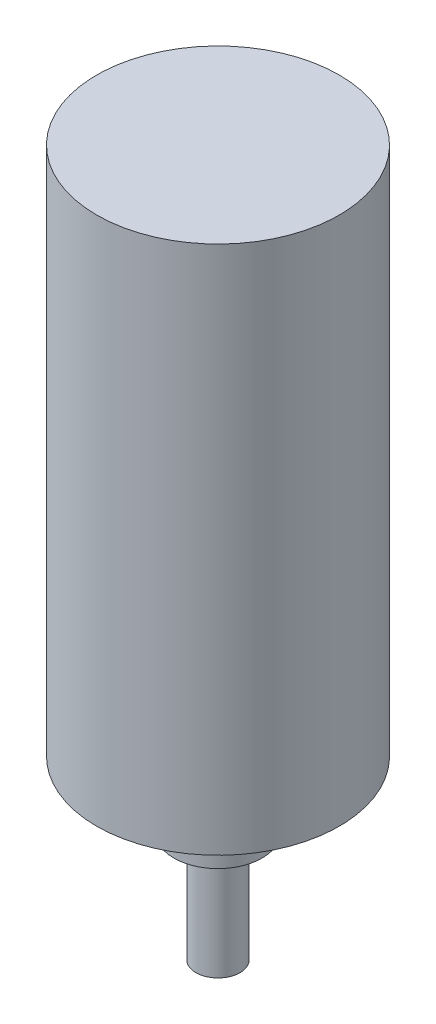
ISO-10303-21;
HEADER;
FILE_DESCRIPTION(('STEP AP214'),'2;1');
FILE_NAME('part.step','',(''),(''),'','','');
FILE_SCHEMA(('AUTOMOTIVE_DESIGN { 1 0 10303 214 1 1 1 1 }'));
ENDSEC;
DATA;
#1=APPLICATION_CONTEXT('core data for automotive mechanical design processes');
#2=APPLICATION_PROTOCOL_DEFINITION('international standard','automotive_design',2000,#1);
#3=PRODUCT_CONTEXT('',#1,'mechanical');
#4=PRODUCT('Part','Part','',(#3));
#5=PRODUCT_RELATED_PRODUCT_CATEGORY('part','',(#4));
#6=PRODUCT_DEFINITION_FORMATION('','',#4);
#7=PRODUCT_DEFINITION_CONTEXT('part definition',#1,'design');
#8=PRODUCT_DEFINITION('design','',#6,#7);
#9=PRODUCT_DEFINITION_SHAPE('','',#8);
#10=(LENGTH_UNIT() NAMED_UNIT(*) SI_UNIT(.MILLI.,.METRE.));
#11=(NAMED_UNIT(*) PLANE_ANGLE_UNIT() SI_UNIT($,.RADIAN.));
#12=(NAMED_UNIT(*) SI_UNIT($,.STERADIAN.) SOLID_ANGLE_UNIT());
#13=UNCERTAINTY_MEASURE_WITH_UNIT(LENGTH_MEASURE(1.E-05),#10,'distance_accuracy_value','');
#14=(GEOMETRIC_REPRESENTATION_CONTEXT(3) GLOBAL_UNCERTAINTY_ASSIGNED_CONTEXT((#13)) GLOBAL_UNIT_ASSIGNED_CONTEXT((#10,
#11,#12)) REPRESENTATION_CONTEXT('',''));
#15=CARTESIAN_POINT('',(0.,0.,0.));
#16=DIRECTION('',(0.,0.,1.));
#17=DIRECTION('',(1.,0.,0.));
#18=AXIS2_PLACEMENT_3D('',#15,#16,#17);
#19=CARTESIAN_POINT('',(0.,8.,0.));
#20=DIRECTION('',(0.,-1.,0.));
#21=DIRECTION('',(0.,0.,-1.));
#22=AXIS2_PLACEMENT_3D('',#19,#20,#21);
#23=CYLINDRICAL_SURFACE('',#22,2.);
#24=CARTESIAN_POINT('',(0.,0.,0.));
#25=DIRECTION('',(0.,1.,0.));
#26=DIRECTION('',(0.,0.,1.));
#27=AXIS2_PLACEMENT_3D('',#24,#25,#26);
#28=CIRCLE('',#27,2.);
#29=CARTESIAN_POINT('',(-1.5,0.,-1.3228756555323));
#30=VERTEX_POINT('',#29);
#31=CARTESIAN_POINT('',(1.5,0.,-1.3228756555323));
#32=VERTEX_POINT('',#31);
#33=EDGE_CURVE('E92',#30,#32,#28,.T.);
#34=ORIENTED_EDGE('',*,*,#33,.T.);
#35=DIRECTION('',(0.,-1.,0.));
#36=VECTOR('',#35,1.);
#37=CARTESIAN_POINT('',(1.5,8.,-1.3228756555323));
#38=LINE('',#37,#36);
#39=CARTESIAN_POINT('',(1.5,8.,-1.3228756555323));
#40=VERTEX_POINT('',#39);
#41=EDGE_CURVE('E11',#40,#32,#38,.T.);
#42=ORIENTED_EDGE('',*,*,#41,.F.);
#43=CARTESIAN_POINT('',(0.,8.,0.));
#44=DIRECTION('',(0.,1.,0.));
#45=DIRECTION('',(0.,0.,1.));
#46=AXIS2_PLACEMENT_3D('',#43,#44,#45);
#47=CIRCLE('',#46,2.);
#48=CARTESIAN_POINT('',(-1.5,8.,-1.3228756555323));
#49=VERTEX_POINT('',#48);
#50=EDGE_CURVE('E81',#40,#49,#47,.T.);
#51=ORIENTED_EDGE('',*,*,#50,.T.);
#52=DIRECTION('',(0.,-1.,0.));
#53=VECTOR('',#52,1.);
#54=CARTESIAN_POINT('',(-1.5,8.,-1.3228756555323));
#55=LINE('',#54,#53);
#56=EDGE_CURVE('E56',#49,#30,#55,.T.);
#57=ORIENTED_EDGE('',*,*,#56,.T.);
#58=EDGE_LOOP('',(#34,#42,#51,#57));
#59=FACE_BOUND('',#58,.T.);
#60=CARTESIAN_POINT('',(0.,10.,0.));
#61=DIRECTION('',(0.,1.,0.));
#62=DIRECTION('',(0.,0.,1.));
#63=AXIS2_PLACEMENT_3D('',#60,#61,#62);
#64=CIRCLE('',#63,2.);
#65=CARTESIAN_POINT('',(0.,10.,2.));
#66=VERTEX_POINT('',#65);
#67=EDGE_CURVE('E86',#66,#66,#64,.T.);
#68=ORIENTED_EDGE('',*,*,#67,.F.);
#69=EDGE_LOOP('',(#68));
#70=FACE_BOUND('',#69,.T.);
#71=ADVANCED_FACE('F47',(#59,#70),#23,.T.);
#72=CARTESIAN_POINT('',(-1.5,8.,-1.3228756555323));
#73=DIRECTION('',(0.,0.,1.));
#74=DIRECTION('',(1.,0.,0.));
#75=AXIS2_PLACEMENT_3D('',#72,#73,#74);
#76=PLANE('',#75);
#77=DIRECTION('',(-1.,0.,0.));
#78=VECTOR('',#77,1.);
#79=CARTESIAN_POINT('',(-1.5,0.,-1.3228756555323));
#80=LINE('',#79,#78);
#81=EDGE_CURVE('E71',#32,#30,#80,.T.);
#82=ORIENTED_EDGE('',*,*,#81,.T.);
#83=ORIENTED_EDGE('',*,*,#56,.F.);
#84=DIRECTION('',(-1.,0.,0.));
#85=VECTOR('',#84,1.);
#86=CARTESIAN_POINT('',(-1.5,8.,-1.3228756555323));
#87=LINE('',#86,#85);
#88=EDGE_CURVE('E62',#40,#49,#87,.T.);
#89=ORIENTED_EDGE('',*,*,#88,.F.);
#90=ORIENTED_EDGE('',*,*,#41,.T.);
#91=EDGE_LOOP('',(#82,#83,#89,#90));
#92=FACE_BOUND('',#91,.T.);
#93=ADVANCED_FACE('F73',(#92),#76,.F.);
#94=CARTESIAN_POINT('',(0.,0.,0.));
#95=DIRECTION('',(0.,1.,0.));
#96=DIRECTION('',(0.,0.,1.));
#97=AXIS2_PLACEMENT_3D('',#94,#95,#96);
#98=PLANE('',#97);
#99=ORIENTED_EDGE('',*,*,#33,.F.);
#100=ORIENTED_EDGE('',*,*,#81,.F.);
#101=EDGE_LOOP('',(#99,#100));
#102=FACE_BOUND('',#101,.T.);
#103=ADVANCED_FACE('F102',(#102),#98,.F.);
#104=CARTESIAN_POINT('',(0.,8.,0.));
#105=DIRECTION('',(0.,1.,0.));
#106=DIRECTION('',(0.,0.,1.));
#107=AXIS2_PLACEMENT_3D('',#104,#105,#106);
#108=PLANE('',#107);
#109=ORIENTED_EDGE('',*,*,#50,.F.);
#110=ORIENTED_EDGE('',*,*,#88,.T.);
#111=EDGE_LOOP('',(#109,#110));
#112=FACE_BOUND('',#111,.T.);
#113=ADVANCED_FACE('F80',(#112),#108,.F.);
#114=CARTESIAN_POINT('',(0.,16.,0.));
#115=DIRECTION('',(0.,-1.,0.));
#116=DIRECTION('',(0.,0.,-1.));
#117=AXIS2_PLACEMENT_3D('',#114,#115,#116);
#118=CYLINDRICAL_SURFACE('',#117,4.);
#119=CARTESIAN_POINT('',(0.,16.,0.));
#120=DIRECTION('',(0.,1.,0.));
#121=DIRECTION('',(0.,0.,1.));
#122=AXIS2_PLACEMENT_3D('',#119,#120,#121);
#123=CIRCLE('',#122,4.);
#124=CARTESIAN_POINT('',(0.,16.,4.));
#125=VERTEX_POINT('',#124);
#126=EDGE_CURVE('E87',#125,#125,#123,.T.);
#127=ORIENTED_EDGE('',*,*,#126,.F.);
#128=EDGE_LOOP('',(#127));
#129=FACE_BOUND('',#128,.T.);
#130=CARTESIAN_POINT('',(0.,10.,0.));
#131=DIRECTION('',(0.,1.,0.));
#132=DIRECTION('',(0.,0.,1.));
#133=AXIS2_PLACEMENT_3D('',#130,#131,#132);
#134=CIRCLE('',#133,4.);
#135=CARTESIAN_POINT('',(0.,10.,4.));
#136=VERTEX_POINT('',#135);
#137=EDGE_CURVE('E95',#136,#136,#134,.T.);
#138=ORIENTED_EDGE('',*,*,#137,.T.);
#139=EDGE_LOOP('',(#138));
#140=FACE_BOUND('',#139,.T.);
#141=ADVANCED_FACE('F109',(#129,#140),#118,.T.);
#142=CARTESIAN_POINT('',(0.,10.,0.));
#143=DIRECTION('',(0.,1.,0.));
#144=DIRECTION('',(0.,0.,1.));
#145=AXIS2_PLACEMENT_3D('',#142,#143,#144);
#146=PLANE('',#145);
#147=ORIENTED_EDGE('',*,*,#67,.T.);
#148=EDGE_LOOP('',(#147));
#149=FACE_BOUND('',#148,.T.);
#150=ORIENTED_EDGE('',*,*,#137,.F.);
#151=EDGE_LOOP('',(#150));
#152=FACE_BOUND('',#151,.T.);
#153=ADVANCED_FACE('F131',(#149,#152),#146,.F.);
#154=CARTESIAN_POINT('',(0.,64.,0.));
#155=DIRECTION('',(0.,-1.,0.));
#156=DIRECTION('',(0.,0.,-1.));
#157=AXIS2_PLACEMENT_3D('',#154,#155,#156);
#158=CYLINDRICAL_SURFACE('',#157,11.);
#159=CARTESIAN_POINT('',(0.,64.,0.));
#160=DIRECTION('',(0.,1.,0.));
#161=DIRECTION('',(0.,0.,1.));
#162=AXIS2_PLACEMENT_3D('',#159,#160,#161);
#163=CIRCLE('',#162,11.);
#164=CARTESIAN_POINT('',(0.,64.,11.));
#165=VERTEX_POINT('',#164);
#166=EDGE_CURVE('E193',#165,#165,#163,.T.);
#167=ORIENTED_EDGE('',*,*,#166,.F.);
#168=EDGE_LOOP('',(#167));
#169=FACE_BOUND('',#168,.T.);
#170=CARTESIAN_POINT('',(0.,16.,0.));
#171=DIRECTION('',(0.,1.,0.));
#172=DIRECTION('',(0.,0.,1.));
#173=AXIS2_PLACEMENT_3D('',#170,#171,#172);
#174=CIRCLE('',#173,11.);
#175=CARTESIAN_POINT('',(0.,16.,11.));
#176=VERTEX_POINT('',#175);
#177=EDGE_CURVE('E190',#176,#176,#174,.T.);
#178=ORIENTED_EDGE('',*,*,#177,.T.);
#179=EDGE_LOOP('',(#178));
#180=FACE_BOUND('',#179,.T.);
#181=ADVANCED_FACE('F140',(#169,#180),#158,.T.);
#182=CARTESIAN_POINT('',(0.,64.,0.));
#183=DIRECTION('',(0.,1.,0.));
#184=DIRECTION('',(0.,0.,1.));
#185=AXIS2_PLACEMENT_3D('',#182,#183,#184);
#186=PLANE('',#185);
#187=ORIENTED_EDGE('',*,*,#166,.T.);
#188=EDGE_LOOP('',(#187));
#189=FACE_BOUND('',#188,.T.);
#190=ADVANCED_FACE('F149',(#189),#186,.T.);
#191=CARTESIAN_POINT('',(0.,16.,0.));
#192=DIRECTION('',(0.,1.,0.));
#193=DIRECTION('',(0.,0.,1.));
#194=AXIS2_PLACEMENT_3D('',#191,#192,#193);
#195=PLANE('',#194);
#196=ORIENTED_EDGE('',*,*,#126,.T.);
#197=EDGE_LOOP('',(#196));
#198=FACE_BOUND('',#197,.T.);
#199=ORIENTED_EDGE('',*,*,#177,.F.);
#200=EDGE_LOOP('',(#199));
#201=FACE_BOUND('',#200,.T.);
#202=ADVANCED_FACE('F158',(#198,#201),#195,.F.);
#203=CLOSED_SHELL('',(#71,#93,#103,#113,#141,#153,#181,#190,#202));
#204=MANIFOLD_SOLID_BREP('B2',#203);
#205=ADVANCED_BREP_SHAPE_REPRESENTATION('',(#18,#204),#14);
#206=SHAPE_DEFINITION_REPRESENTATION(#9,#205);
ENDSEC;
END-ISO-10303-21;
